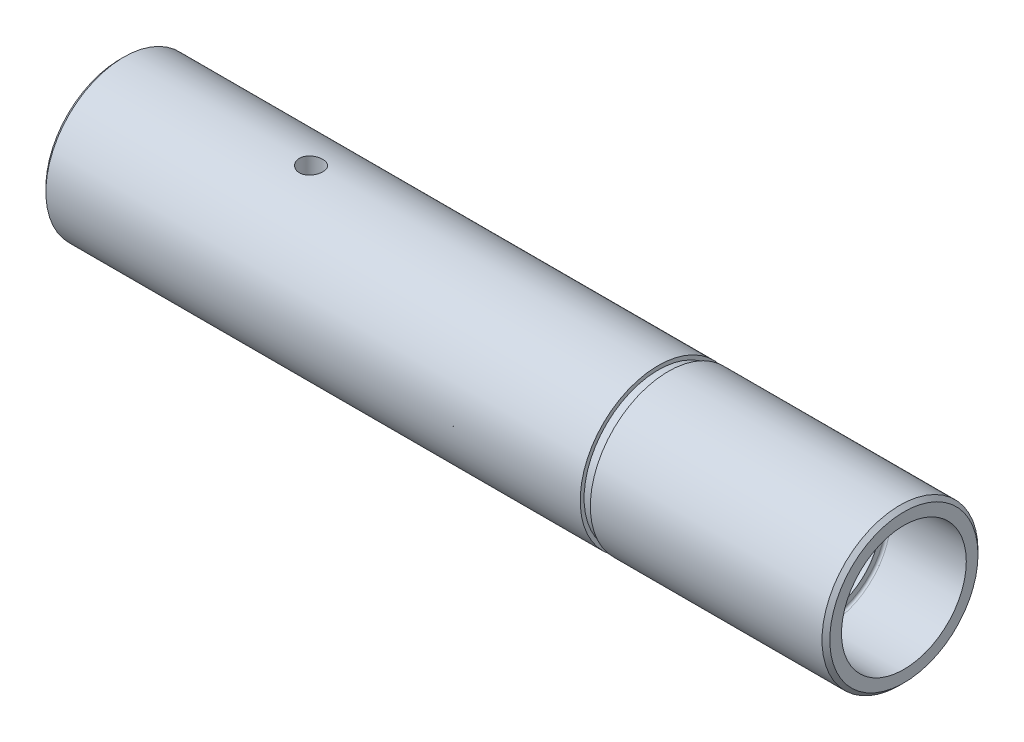
ISO-10303-21;
HEADER;
FILE_DESCRIPTION(('STEP AP214'),'2;1');
FILE_NAME('part.step','',(''),(''),'','','');
FILE_SCHEMA(('AUTOMOTIVE_DESIGN { 1 0 10303 214 1 1 1 1 }'));
ENDSEC;
DATA;
#1=APPLICATION_CONTEXT('core data for automotive mechanical design processes');
#2=APPLICATION_PROTOCOL_DEFINITION('international standard','automotive_design',2000,#1);
#3=PRODUCT_CONTEXT('',#1,'mechanical');
#4=PRODUCT('Part','Part','',(#3));
#5=PRODUCT_RELATED_PRODUCT_CATEGORY('part','',(#4));
#6=PRODUCT_DEFINITION_FORMATION('','',#4);
#7=PRODUCT_DEFINITION_CONTEXT('part definition',#1,'design');
#8=PRODUCT_DEFINITION('design','',#6,#7);
#9=PRODUCT_DEFINITION_SHAPE('','',#8);
#10=(LENGTH_UNIT() NAMED_UNIT(*) SI_UNIT(.MILLI.,.METRE.));
#11=(NAMED_UNIT(*) PLANE_ANGLE_UNIT() SI_UNIT($,.RADIAN.));
#12=(NAMED_UNIT(*) SI_UNIT($,.STERADIAN.) SOLID_ANGLE_UNIT());
#13=UNCERTAINTY_MEASURE_WITH_UNIT(LENGTH_MEASURE(1.E-05),#10,'distance_accuracy_value','');
#14=(GEOMETRIC_REPRESENTATION_CONTEXT(3) GLOBAL_UNCERTAINTY_ASSIGNED_CONTEXT((#13)) GLOBAL_UNIT_ASSIGNED_CONTEXT((#10,
#11,#12)) REPRESENTATION_CONTEXT('',''));
#15=CARTESIAN_POINT('',(0.,0.,0.));
#16=DIRECTION('',(0.,0.,1.));
#17=DIRECTION('',(1.,0.,0.));
#18=AXIS2_PLACEMENT_3D('',#15,#16,#17);
#19=CARTESIAN_POINT('',(100.5,0.,0.));
#20=DIRECTION('',(-1.,0.,0.));
#21=DIRECTION('',(0.,0.,1.));
#22=AXIS2_PLACEMENT_3D('',#19,#20,#21);
#23=CYLINDRICAL_SURFACE('',#22,10.);
#24=CARTESIAN_POINT('',(0.499999999999987,0.,0.));
#25=DIRECTION('',(1.,0.,0.));
#26=DIRECTION('',(0.,0.,-1.));
#27=AXIS2_PLACEMENT_3D('',#24,#25,#26);
#28=CIRCLE('',#27,10.);
#29=CARTESIAN_POINT('',(0.499999999999987,0.,-10.));
#30=VERTEX_POINT('',#29);
#31=EDGE_CURVE('E59',#30,#30,#28,.T.);
#32=ORIENTED_EDGE('',*,*,#31,.T.);
#33=EDGE_LOOP('',(#32));
#34=FACE_BOUND('',#33,.T.);
#35=CARTESIAN_POINT('',(23.,-10.,0.));
#36=CARTESIAN_POINT('',(23.0000034538152,-9.99999865771297,0.0837515444816421));
#37=CARTESIAN_POINT('',(23.0070380008406,-9.9989368253704,0.167551685082132));
#38=CARTESIAN_POINT('',(23.0349831999828,-9.99480315973187,0.332809627994913));
#39=CARTESIAN_POINT('',(23.0559073629449,-9.99172936938473,0.414265068974229));
#40=CARTESIAN_POINT('',(23.1109925049676,-9.98391721219526,0.57241808622186));
#41=CARTESIAN_POINT('',(23.145143479506,-9.97918010370919,0.649119207826799));
#42=CARTESIAN_POINT('',(23.2256883794169,-9.96856475911724,0.795690428635255));
#43=CARTESIAN_POINT('',(23.2720806044174,-9.96268668152773,0.865561474725189));
#44=CARTESIAN_POINT('',(23.3761772649399,-9.95039170991452,0.997046719562126));
#45=CARTESIAN_POINT('',(23.4339584562082,-9.94397133890331,1.0585998322255));
#46=CARTESIAN_POINT('',(23.5590276888939,-9.93134261133238,1.17117490668949));
#47=CARTESIAN_POINT('',(23.6263162767785,-9.92513426698505,1.22219626272936));
#48=CARTESIAN_POINT('',(23.7689006435225,-9.91359877458726,1.31249729499943));
#49=CARTESIAN_POINT('',(23.8442342469813,-9.90827611975031,1.35171787037205));
#50=CARTESIAN_POINT('',(24.0005128206454,-9.89916211306268,1.41692632171056));
#51=CARTESIAN_POINT('',(24.0814574847439,-9.89537067775449,1.44291491889163));
#52=CARTESIAN_POINT('',(24.2460180418717,-9.88978256218673,1.48073198798911));
#53=CARTESIAN_POINT('',(24.329609393408,-9.8879711574125,1.49266503640518));
#54=CARTESIAN_POINT('',(24.4976261659873,-9.88650348970582,1.50235624033932));
#55=CARTESIAN_POINT('',(24.5820515388625,-9.88684710303147,1.50011520973796));
#56=CARTESIAN_POINT('',(24.7486010801941,-9.88963718352409,1.48160733250788));
#57=CARTESIAN_POINT('',(24.8307385264848,-9.89206618761549,1.4654569592775));
#58=CARTESIAN_POINT('',(24.9911243688715,-9.89872608126367,1.41977117403734));
#59=CARTESIAN_POINT('',(25.0693726548807,-9.90295702179379,1.39023538337812));
#60=CARTESIAN_POINT('',(25.2201133712829,-9.91276335545481,1.31849603529737));
#61=CARTESIAN_POINT('',(25.2925819690924,-9.91834396766526,1.27624314283198));
#62=CARTESIAN_POINT('',(25.4294445957819,-9.93021707574548,1.18030413128955));
#63=CARTESIAN_POINT('',(25.4938380942694,-9.93650961832501,1.12661726182478));
#64=CARTESIAN_POINT('',(25.6133976607397,-9.94917473056209,1.00869493078248));
#65=CARTESIAN_POINT('',(25.6684649902863,-9.95554747112815,0.944359329642003));
#66=CARTESIAN_POINT('',(25.7670359345073,-9.96759647648462,0.807307089894187));
#67=CARTESIAN_POINT('',(25.8105394985439,-9.9732727382251,0.734590414588171));
#68=CARTESIAN_POINT('',(25.8847530864995,-9.98329515585393,0.582754598213686));
#69=CARTESIAN_POINT('',(25.9154554918403,-9.98764051925428,0.50363167783678));
#70=CARTESIAN_POINT('',(25.9631093896854,-9.99450490557069,0.34127318248706));
#71=CARTESIAN_POINT('',(25.9800618118156,-9.99702405195467,0.2580378859526));
#72=CARTESIAN_POINT('',(25.9996032298167,-9.99993581133871,0.0906695676436462));
#73=CARTESIAN_POINT('',(26.0023279713793,-10.0003485209039,0.00655273187047008));
#74=CARTESIAN_POINT('',(25.993696994689,-9.99905561015226,-0.160936677662283));
#75=CARTESIAN_POINT('',(25.9823417123319,-9.99735005541369,-0.244309274381877));
#76=CARTESIAN_POINT('',(25.9459858998225,-9.99202468615333,-0.407532387431408));
#77=CARTESIAN_POINT('',(25.9210515039692,-9.98841415207984,-0.487397963079839));
#78=CARTESIAN_POINT('',(25.8583150025382,-9.97968235658369,-0.641814958643));
#79=CARTESIAN_POINT('',(25.8205122926664,-9.97456102421565,-0.716366128795099));
#80=CARTESIAN_POINT('',(25.7327937754361,-9.96332682468686,-0.85863497929192));
#81=CARTESIAN_POINT('',(25.6827918599872,-9.95720701626745,-0.926299009891565));
#82=CARTESIAN_POINT('',(25.5722141883713,-9.94467863012165,-1.05232367317771));
#83=CARTESIAN_POINT('',(25.5116378176754,-9.93827003562867,-1.1106837647934));
#84=CARTESIAN_POINT('',(25.3810264668235,-9.92582264304494,-1.21693784957195));
#85=CARTESIAN_POINT('',(25.3109170748052,-9.91978736017588,-1.26474084747421));
#86=CARTESIAN_POINT('',(25.1635839594882,-9.90883219104903,-1.34789129270584));
#87=CARTESIAN_POINT('',(25.0863604284785,-9.90391227465628,-1.38323907656436));
#88=CARTESIAN_POINT('',(24.9272624663769,-9.89577033008645,-1.44033467323943));
#89=CARTESIAN_POINT('',(24.8454055390288,-9.89254233006438,-1.46213037141635));
#90=CARTESIAN_POINT('',(24.6791409845649,-9.88813382297802,-1.49165549501586));
#91=CARTESIAN_POINT('',(24.5947335340053,-9.88695317451771,-1.49938589183067));
#92=CARTESIAN_POINT('',(24.4266709366842,-9.88677832610841,-1.5005378666944));
#93=CARTESIAN_POINT('',(24.3430167582431,-9.88776226333502,-1.49410252167313));
#94=CARTESIAN_POINT('',(24.1779947366765,-9.89175820611174,-1.46741229544379));
#95=CARTESIAN_POINT('',(24.0966268898866,-9.89477020841117,-1.44715743638627));
#96=CARTESIAN_POINT('',(23.9385269177657,-9.90247526112297,-1.39345373518665));
#97=CARTESIAN_POINT('',(23.8617913295666,-9.90716703716075,-1.36001489324314));
#98=CARTESIAN_POINT('',(23.7149963661976,-9.91770454557702,-1.28090667642309));
#99=CARTESIAN_POINT('',(23.6449372171964,-9.92355031702724,-1.23523688741502));
#100=CARTESIAN_POINT('',(23.5127569420248,-9.93580743364938,-1.13244337659164));
#101=CARTESIAN_POINT('',(23.4507186667529,-9.94222367881967,-1.07521369039806));
#102=CARTESIAN_POINT('',(23.3370754452122,-9.95485788826636,-0.951148841082835));
#103=CARTESIAN_POINT('',(23.2854729274238,-9.96107580610759,-0.884311448350941));
#104=CARTESIAN_POINT('',(23.1939123233926,-9.9726518579052,-0.742495707543721));
#105=CARTESIAN_POINT('',(23.1540198907853,-9.9780050712882,-0.667474576764759));
#106=CARTESIAN_POINT('',(23.087461483242,-9.98720028802959,-0.511751870248718));
#107=CARTESIAN_POINT('',(23.0607818099463,-9.99104385565757,-0.431056277096704));
#108=CARTESIAN_POINT('',(23.0274586572899,-9.99590939261505,-0.291665727889329));
#109=CARTESIAN_POINT('',(23.0171773984612,-9.99743549179557,-0.233831133495278));
#110=CARTESIAN_POINT('',(23.0034469022874,-9.99948125947896,-0.117338971600125));
#111=CARTESIAN_POINT('',(22.9999975800475,-10.0000009404877,-0.0586814143344171));
#112=CARTESIAN_POINT('',(23.,-10.,0.));
#113=B_SPLINE_CURVE_WITH_KNOTS('',3,(#35,#36,#37,#38,#39,#40,#41,#42,#43,#44,#45,#46,#47,#48,
#49,#50,#51,#52,#53,#54,#55,#56,#57,#58,#59,#60,#61,#62,#63,#64,#65,#66,#67,#68,#69,#70,#71,#72,
#73,#74,#75,#76,#77,#78,#79,#80,#81,#82,#83,#84,#85,#86,#87,#88,#89,#90,#91,#92,#93,#94,#95,#96,
#97,#98,#99,#100,#101,#102,#103,#104,#105,#106,#107,#108,#109,#110,#111,#112),.UNSPECIFIED.,.T.,
.F.,(4,2,2,2,2,2,2,2,2,2,2,2,2,2,2,2,2,2,2,2,2,2,2,2,2,2,2,2,2,2,2,2,2,2,2,2,2,2,4),(0.,
0.251040205031663,0.50232496292915,0.753420023583237,1.0044802241976,1.25729416136843,
1.5101226357258,1.76419702395375,2.01825756225506,2.27041564605924,2.52255925098982,
2.77261177195746,3.02267136690361,3.27371383476159,3.52477278308534,3.77834291255409,
4.03191415238668,4.28563608984875,4.53934087193401,4.79062058544255,5.04189251991155,
5.29195148965948,5.54202220376274,5.79391188036907,6.0458162002863,6.29981366584672,
6.55380426808832,6.80689223457168,7.05996272137177,7.31048888261064,7.56101464229564,
7.81135073984147,8.0616953146688,8.31444829965721,8.56726003468734,8.82146323384734,
9.07540233261442,9.25129851978809,9.42719252123291),.UNSPECIFIED.);
#114=CARTESIAN_POINT('',(23.,-10.,0.));
#115=VERTEX_POINT('',#114);
#116=EDGE_CURVE('E100',#115,#115,#113,.T.);
#117=ORIENTED_EDGE('',*,*,#116,.T.);
#118=EDGE_LOOP('',(#117));
#119=FACE_BOUND('',#118,.T.);
#120=CARTESIAN_POINT('',(24.5,9.88685996664259,1.5));
#121=CARTESIAN_POINT('',(24.41625443071,9.88686136668593,1.49999654107284));
#122=CARTESIAN_POINT('',(24.3324602492493,9.88793551739101,1.49296296388491));
#123=CARTESIAN_POINT('',(24.1672146851169,9.8921131480324,1.46502196657001));
#124=CARTESIAN_POINT('',(24.08576566852,9.8952186073143,1.44410101402628));
#125=CARTESIAN_POINT('',(23.9276262445531,9.90309938986228,1.38902526098084));
#126=CARTESIAN_POINT('',(23.8509322374578,9.90787343131536,1.35488061681397));
#127=CARTESIAN_POINT('',(23.7043729692279,9.91855194113145,1.27435063087791));
#128=CARTESIAN_POINT('',(23.6345067697857,9.92445625383668,1.22796697429872));
#129=CARTESIAN_POINT('',(23.5030161832457,9.9367828924804,1.12387902418559));
#130=CARTESIAN_POINT('',(23.4414543865933,9.94320862458057,1.0660960558482));
#131=CARTESIAN_POINT('',(23.3288625143445,9.95582368169047,0.941019605444376));
#132=CARTESIAN_POINT('',(23.277833017833,9.96201299368615,0.873725600786532));
#133=CARTESIAN_POINT('',(23.1875233683086,9.97349347428185,0.731136358052747));
#134=CARTESIAN_POINT('',(23.1483008496775,9.97878018435569,0.655804227365769));
#135=CARTESIAN_POINT('',(23.0830884011918,9.98782206746405,0.499528850106976));
#136=CARTESIAN_POINT('',(23.0570977721571,9.99157732141945,0.418585900270678));
#137=CARTESIAN_POINT('',(23.0192766114692,9.99710914797782,0.254031123090569));
#138=CARTESIAN_POINT('',(23.0073412736128,9.99890035887344,0.170443884389866));
#139=CARTESIAN_POINT('',(22.9976440651751,10.0003524476958,0.00243520401947946));
#140=CARTESIAN_POINT('',(22.9998814066803,10.0000134440494,-0.0819861910157454));
#141=CARTESIAN_POINT('',(23.0183833377624,9.99725499660796,-0.248551718200518));
#142=CARTESIAN_POINT('',(23.0345351717915,9.99485227652479,-0.330708691400006));
#143=CARTESIAN_POINT('',(23.0802306063226,9.98825500227851,-0.491132829143136));
#144=CARTESIAN_POINT('',(23.1097745515014,9.98406040199739,-0.56939989351348));
#145=CARTESIAN_POINT('',(23.1815309969171,9.97432193873206,-0.720163780770315));
#146=CARTESIAN_POINT('',(23.2237909651087,9.96877303515638,-0.792637672323595));
#147=CARTESIAN_POINT('',(23.31974519367,9.95694438245421,-0.929507907150176));
#148=CARTESIAN_POINT('',(23.3734402067069,9.95066458523184,-0.993903718271734));
#149=CARTESIAN_POINT('',(23.4913684488266,9.93800158192627,-1.11345448272264));
#150=CARTESIAN_POINT('',(23.5557001219701,9.93161796623256,-1.16851232950947));
#151=CARTESIAN_POINT('',(23.6927410771237,9.91952704453523,-1.26706599338813));
#152=CARTESIAN_POINT('',(23.7654504107199,9.91381974269649,-1.31056173927999));
#153=CARTESIAN_POINT('',(23.9172839629406,9.90372775286855,-1.38476964534605));
#154=CARTESIAN_POINT('',(23.9964131336624,9.89934409845291,-1.41547182270082));
#155=CARTESIAN_POINT('',(24.1587852551474,9.89241402899059,-1.46312336208879));
#156=CARTESIAN_POINT('',(24.2420279155468,9.88986748446299,-1.48007369337326));
#157=CARTESIAN_POINT('',(24.4094000895775,9.88692451395027,-1.49960720086655));
#158=CARTESIAN_POINT('',(24.4935131882015,9.88650748802574,-1.50232803265052));
#159=CARTESIAN_POINT('',(24.6609941948173,9.88781607937153,-1.49369057019819));
#160=CARTESIAN_POINT('',(24.7443621258508,9.88954163015778,-1.48233271282302));
#161=CARTESIAN_POINT('',(24.9075598179656,9.89492202461453,-1.44597702952766));
#162=CARTESIAN_POINT('',(24.9874052049416,9.89856716482858,-1.42104778527821));
#163=CARTESIAN_POINT('',(25.1417840920486,9.90736801825768,-1.35832831947087));
#164=CARTESIAN_POINT('',(25.2163173296282,9.91252380607176,-1.32053746276389));
#165=CARTESIAN_POINT('',(25.358573260335,9.92381355687063,-1.23283677995324));
#166=CARTESIAN_POINT('',(25.4262404472798,9.92995459279988,-1.18283784561767));
#167=CARTESIAN_POINT('',(25.5522728598738,9.94250159433355,-1.07226416837202));
#168=CARTESIAN_POINT('',(25.6106375591811,9.94890757490292,-1.0116888274468));
#169=CARTESIAN_POINT('',(25.7169026066336,9.96132705217386,-0.881075619628186));
#170=CARTESIAN_POINT('',(25.7647117282425,9.96733683460423,-0.81096312677196));
#171=CARTESIAN_POINT('',(25.8478729052626,9.97822905032015,-0.663622080263684));
#172=CARTESIAN_POINT('',(25.883225301465,9.98311151444563,-0.586393721360441));
#173=CARTESIAN_POINT('',(25.940323742488,9.99118269660795,-0.427297995861148));
#174=CARTESIAN_POINT('',(25.9621196670784,9.99437761717899,-0.345448858754304));
#175=CARTESIAN_POINT('',(25.9916478795375,9.99873976656896,-0.179200815501195));
#176=CARTESIAN_POINT('',(25.9993810962491,9.99990712930801,-0.0948020781305827));
#177=CARTESIAN_POINT('',(26.0005417045494,10.0000812905914,0.0732645908608167));
#178=CARTESIAN_POINT('',(25.994108680877,9.99910917023796,0.15693157021205));
#179=CARTESIAN_POINT('',(25.9674186115792,9.99515610519141,0.321979795323105));
#180=CARTESIAN_POINT('',(25.9471616101914,9.99217516692666,0.403361048396511));
#181=CARTESIAN_POINT('',(25.8934481244298,9.98453786742463,0.561489374379659));
#182=CARTESIAN_POINT('',(25.8600013048611,9.97988273316947,0.638239793148781));
#183=CARTESIAN_POINT('',(25.7808725120169,9.96940834495499,0.785061117896601));
#184=CARTESIAN_POINT('',(25.7351901415197,9.96358905320338,0.855131806920708));
#185=CARTESIAN_POINT('',(25.6323823011708,9.95136510636178,0.987312585191959));
#186=CARTESIAN_POINT('',(25.5751537741837,9.94495548425942,1.04934206644638));
#187=CARTESIAN_POINT('',(25.4510949269195,9.93231001689001,1.16296808390268));
#188=CARTESIAN_POINT('',(25.3842623561757,9.92607421276291,1.21456216798984));
#189=CARTESIAN_POINT('',(25.2424510167675,9.91444484029116,1.30611310822974));
#190=CARTESIAN_POINT('',(25.1674285829782,9.90905620156985,1.34600294291209));
#191=CARTESIAN_POINT('',(25.0117032232367,9.89978909110724,1.41255613872045));
#192=CARTESIAN_POINT('',(24.9310062921422,9.89590905307931,1.43923322574898));
#193=CARTESIAN_POINT('',(24.7916225637435,9.89099485524825,1.47254951890026));
#194=CARTESIAN_POINT('',(24.7337966030757,9.88945249382379,1.4828276978042));
#195=CARTESIAN_POINT('',(24.6173217082656,9.88738456567011,1.49655410576574));
#196=CARTESIAN_POINT('',(24.5586727848004,9.88685898576155,1.50000242335076));
#197=CARTESIAN_POINT('',(24.5,9.88685996664259,1.5));
#198=B_SPLINE_CURVE_WITH_KNOTS('',3,(#120,#121,#122,#123,#124,#125,#126,#127,#128,#129,#130,
#131,#132,#133,#134,#135,#136,#137,#138,#139,#140,#141,#142,#143,#144,#145,#146,#147,#148,#149,
#150,#151,#152,#153,#154,#155,#156,#157,#158,#159,#160,#161,#162,#163,#164,#165,#166,#167,#168,
#169,#170,#171,#172,#173,#174,#175,#176,#177,#178,#179,#180,#181,#182,#183,#184,#185,#186,#187,
#188,#189,#190,#191,#192,#193,#194,#195,#196,#197),.UNSPECIFIED.,.T.,.F.,(4,2,2,2,2,2,2,2,2,2,2,
2,2,2,2,2,2,2,2,2,2,2,2,2,2,2,2,2,2,2,2,2,2,2,2,2,2,2,4),(0.,0.251022251804865,0.5022894695618,
0.753364085335672,1.00440414866132,1.25724158649107,1.51009292207817,1.76415922105782,
2.01821209364501,2.27035832534397,2.52249053939374,2.77259862515728,3.02271314839401,
3.27377316386454,3.52484970949272,3.77839544666269,4.0319427451435,4.28568751773139,
4.53941440444341,4.79068214603744,5.04194209099918,5.29194394807374,5.54195815286117,
5.79385486001302,6.04576581461802,6.29977537753516,6.55377799071854,6.8068404089109,
7.05988611170473,7.31044963622327,7.56101235892823,7.81139182257833,8.06177941567107,
8.3145095001097,8.56729890236863,8.82150878824932,9.07545403445564,9.25132441891614,
9.42719252376193),.UNSPECIFIED.);
#199=CARTESIAN_POINT('',(24.5,9.88685996664259,1.5));
#200=VERTEX_POINT('',#199);
#201=EDGE_CURVE('E71',#200,#200,#198,.T.);
#202=ORIENTED_EDGE('',*,*,#201,.T.);
#203=EDGE_LOOP('',(#202));
#204=FACE_BOUND('',#203,.T.);
#205=CARTESIAN_POINT('',(69.,0.,0.));
#206=DIRECTION('',(1.,0.,0.));
#207=DIRECTION('',(0.,0.,-1.));
#208=AXIS2_PLACEMENT_3D('',#205,#206,#207);
#209=CIRCLE('',#208,10.);
#210=CARTESIAN_POINT('',(69.,0.,-10.));
#211=VERTEX_POINT('',#210);
#212=EDGE_CURVE('E145',#211,#211,#209,.T.);
#213=ORIENTED_EDGE('',*,*,#212,.F.);
#214=EDGE_LOOP('',(#213));
#215=FACE_BOUND('',#214,.T.);
#216=ADVANCED_FACE('F30',(#34,#119,#204,#215),#23,.T.);
#217=CARTESIAN_POINT('',(100.5,0.,0.));
#218=DIRECTION('',(-1.,0.,0.));
#219=DIRECTION('',(0.,0.,1.));
#220=AXIS2_PLACEMENT_3D('',#217,#218,#219);
#221=CYLINDRICAL_SURFACE('',#220,7.);
#222=CARTESIAN_POINT('',(24.5,-6.83739716558867,1.5));
#223=CARTESIAN_POINT('',(24.583211152482,-6.83739884558951,1.49999708238613));
#224=CARTESIAN_POINT('',(24.6664577739421,-6.83893272341929,1.49305236244768));
#225=CARTESIAN_POINT('',(24.830586672242,-6.84489178429867,1.46548559252999));
#226=CARTESIAN_POINT('',(24.9114671486762,-6.84931911211841,1.44485339653622));
#227=CARTESIAN_POINT('',(25.0684657495742,-6.86054115293409,1.39058863684599));
#228=CARTESIAN_POINT('',(25.1445888781215,-6.86733332725825,1.35697000991314));
#229=CARTESIAN_POINT('',(25.2901152739446,-6.88251670848644,1.27772617673341));
#230=CARTESIAN_POINT('',(25.3595187370291,-6.89090786877545,1.23210132048776));
#231=CARTESIAN_POINT('',(25.4907629614821,-6.90849578796654,1.12935142570221));
#232=CARTESIAN_POINT('',(25.55247887624,-6.91770249871753,1.07206859483983));
#233=CARTESIAN_POINT('',(25.6655035544058,-6.93579691710397,0.947969508129577));
#234=CARTESIAN_POINT('',(25.7168115288601,-6.94468460051416,0.881152530217677));
#235=CARTESIAN_POINT('',(25.8080554444914,-6.96124769109432,0.739047288464582));
#236=CARTESIAN_POINT('',(25.8478716557706,-6.96890998819429,0.663680488229953));
#237=CARTESIAN_POINT('',(25.9142276914463,-6.98204671042934,0.507134269342594));
#238=CARTESIAN_POINT('',(25.9407689447863,-6.98752137103329,0.425955477380311));
#239=CARTESIAN_POINT('',(25.9794299709313,-6.9955956528118,0.261387187671511));
#240=CARTESIAN_POINT('',(25.9917609285524,-6.99823733378385,0.178049400596922));
#241=CARTESIAN_POINT('',(26.0023112773133,-7.00049362207002,0.010448945306644));
#242=CARTESIAN_POINT('',(26.0005322205608,-7.00010856232698,-0.0738136201647595));
#243=CARTESIAN_POINT('',(25.9830710353364,-6.99638700862558,-0.239417029250512));
#244=CARTESIAN_POINT('',(25.9676164997101,-6.99309883152432,-0.320783115362112));
#245=CARTESIAN_POINT('',(25.9236053181481,-6.98399541589104,-0.479739463978388));
#246=CARTESIAN_POINT('',(25.8950480957003,-6.97818006616518,-0.557329560175053));
#247=CARTESIAN_POINT('',(25.8254385411115,-6.96459754646858,-0.707167497556553));
#248=CARTESIAN_POINT('',(25.7842992327957,-6.95681685803946,-0.77937365701579));
#249=CARTESIAN_POINT('',(25.6907580318364,-6.94015793743865,-0.915940926562848));
#250=CARTESIAN_POINT('',(25.6383546626997,-6.93127956144693,-0.98030100645153));
#251=CARTESIAN_POINT('',(25.5225314554721,-6.91319326460925,-1.10070208800198));
#252=CARTESIAN_POINT('',(25.458912420643,-6.90398230372853,-1.15655117320251));
#253=CARTESIAN_POINT('',(25.3231167149315,-6.88643566831974,-1.25682243234728));
#254=CARTESIAN_POINT('',(25.2509398305948,-6.87810001563386,-1.30124432118068));
#255=CARTESIAN_POINT('',(25.0997754989362,-6.86324023586723,-1.37748077573296));
#256=CARTESIAN_POINT('',(25.0207698761476,-6.85672115127775,-1.40926035088923));
#257=CARTESIAN_POINT('',(24.8583672340536,-6.84630340806617,-1.45903495159115));
#258=CARTESIAN_POINT('',(24.7749708825568,-6.84240435218483,-1.47703206694628));
#259=CARTESIAN_POINT('',(24.6079042473503,-6.83774881255446,-1.49843586024652));
#260=CARTESIAN_POINT('',(24.5242713249227,-6.83693227051701,-1.5021214192864));
#261=CARTESIAN_POINT('',(24.3575860068183,-6.83837239573994,-1.49555139642373));
#262=CARTESIAN_POINT('',(24.2745335733464,-6.84062886101063,-1.48529673081635));
#263=CARTESIAN_POINT('',(24.1123295650192,-6.84790415484206,-1.45137894635584));
#264=CARTESIAN_POINT('',(24.033144567403,-6.85289155274364,-1.42786830251554));
#265=CARTESIAN_POINT('',(23.8798376624671,-6.86503859869777,-1.3682705294675));
#266=CARTESIAN_POINT('',(23.8057162243658,-6.87219844772849,-1.33218223662818));
#267=CARTESIAN_POINT('',(23.6634303152411,-6.88801634080345,-1.24783504416705));
#268=CARTESIAN_POINT('',(23.5953704179878,-6.89669501746317,-1.19940368590792));
#269=CARTESIAN_POINT('',(23.4682416541262,-6.91451775360139,-1.091971838336));
#270=CARTESIAN_POINT('',(23.4091738585515,-6.92366186834461,-1.03297009182161));
#271=CARTESIAN_POINT('',(23.3006296970552,-6.94158239990173,-0.904812764420814));
#272=CARTESIAN_POINT('',(23.251343083843,-6.95034935607746,-0.83549492582877));
#273=CARTESIAN_POINT('',(23.165114590649,-6.96635610714901,-0.689401481282275));
#274=CARTESIAN_POINT('',(23.1281721470272,-6.97359597176692,-0.612626216043738));
#275=CARTESIAN_POINT('',(23.0679479453615,-6.98569278381574,-0.45426541898204));
#276=CARTESIAN_POINT('',(23.0445816962537,-6.99056443803698,-0.372713193075172));
#277=CARTESIAN_POINT('',(23.0119082942677,-6.9974393930198,-0.206725177003289));
#278=CARTESIAN_POINT('',(23.0025991840261,-6.99944309312296,-0.122289789973993));
#279=CARTESIAN_POINT('',(22.9983893475881,-7.00034511009057,0.0452637170528302));
#280=CARTESIAN_POINT('',(23.0032048413954,-6.99930459001667,0.12837450550923));
#281=CARTESIAN_POINT('',(23.026474763519,-6.99436552363383,0.292572938415962));
#282=CARTESIAN_POINT('',(23.0449289655783,-6.99046702473686,0.373660616405286));
#283=CARTESIAN_POINT('',(23.0948188062495,-6.98025388638537,0.53130194848727));
#284=CARTESIAN_POINT('',(23.1262156893856,-6.97394646430493,0.607868365073177));
#285=CARTESIAN_POINT('',(23.2010612711691,-6.95959036050661,0.75468495672322));
#286=CARTESIAN_POINT('',(23.244511088306,-6.9515415172034,0.824934544796141));
#287=CARTESIAN_POINT('',(23.3431623187427,-6.93439809934493,0.958512306895244));
#288=CARTESIAN_POINT('',(23.3985641583213,-6.92528708907874,1.02169036510578));
#289=CARTESIAN_POINT('',(23.5191406102503,-6.90713690075836,1.13795001457643));
#290=CARTESIAN_POINT('',(23.5843175633556,-6.89809774045682,1.19102918062422));
#291=CARTESIAN_POINT('',(23.7235904931857,-6.88098693651916,1.28623261596675));
#292=CARTESIAN_POINT('',(23.797789358287,-6.87292905956533,1.32820897809616));
#293=CARTESIAN_POINT('',(23.9523437209233,-6.85886497228049,1.39903004659825));
#294=CARTESIAN_POINT('',(24.0326938452531,-6.85285699581573,1.42788606423931));
#295=CARTESIAN_POINT('',(24.1776261311859,-6.84470560641996,1.46638607121558));
#296=CARTESIAN_POINT('',(24.2414116757078,-6.84198283087953,1.47896752507743));
#297=CARTESIAN_POINT('',(24.3701243115773,-6.83832799504406,1.49577544043437));
#298=CARTESIAN_POINT('',(24.4350513515083,-6.83739585430069,1.50000227727981));
#299=CARTESIAN_POINT('',(24.5,-6.83739716558867,1.5));
#300=B_SPLINE_CURVE_WITH_KNOTS('',3,(#222,#223,#224,#225,#226,#227,#228,#229,#230,#231,#232,
#233,#234,#235,#236,#237,#238,#239,#240,#241,#242,#243,#244,#245,#246,#247,#248,#249,#250,#251,
#252,#253,#254,#255,#256,#257,#258,#259,#260,#261,#262,#263,#264,#265,#266,#267,#268,#269,#270,
#271,#272,#273,#274,#275,#276,#277,#278,#279,#280,#281,#282,#283,#284,#285,#286,#287,#288,#289,
#290,#291,#292,#293,#294,#295,#296,#297,#298,#299),.UNSPECIFIED.,.T.,.F.,(4,2,2,2,2,2,2,2,2,2,2,
2,2,2,2,2,2,2,2,2,2,2,2,2,2,2,2,2,2,2,2,2,2,2,2,2,2,2,4),(0.,0.249395482027527,
0.498976038479964,0.74828949115276,0.997595676735285,1.25053229582692,1.50348808112879,
1.75899134820278,2.01446710646268,2.26609508151929,2.51769537777241,2.76518557667371,
3.01268666607584,3.26193888143437,3.51122378872315,3.76548960779295,4.01976177023092,
4.27473287411781,4.52966530953839,4.77960433192523,5.02952692653917,5.27663180749375,
5.5237595556315,5.77455010216318,6.02537049659078,6.28066214683211,6.53594213875542,
6.78961589824375,7.04325433208539,7.29183199644127,7.540405537151,7.78824009619483,
8.03609766151366,8.28848914160965,8.54094115631233,8.79660380167249,9.05204561611688,
9.24671456122272,9.44137476018023),.UNSPECIFIED.);
#301=CARTESIAN_POINT('',(24.5,-6.83739716558867,1.5));
#302=VERTEX_POINT('',#301);
#303=EDGE_CURVE('E63',#302,#302,#300,.T.);
#304=ORIENTED_EDGE('',*,*,#303,.F.);
#305=EDGE_LOOP('',(#304));
#306=FACE_BOUND('',#305,.T.);
#307=CARTESIAN_POINT('',(24.5,6.83739716558867,1.5));
#308=CARTESIAN_POINT('',(24.416788847518,6.83739884558951,1.49999708238613));
#309=CARTESIAN_POINT('',(24.3335422260579,6.83893272341929,1.49305236244768));
#310=CARTESIAN_POINT('',(24.169413327758,6.84489178429867,1.46548559252999));
#311=CARTESIAN_POINT('',(24.0885328513238,6.84931911211841,1.44485339653622));
#312=CARTESIAN_POINT('',(23.9315342504258,6.86054115293409,1.39058863684599));
#313=CARTESIAN_POINT('',(23.8554111218785,6.86733332725825,1.35697000991314));
#314=CARTESIAN_POINT('',(23.7098847260554,6.88251670848644,1.27772617673341));
#315=CARTESIAN_POINT('',(23.6404812629709,6.89090786877545,1.23210132048776));
#316=CARTESIAN_POINT('',(23.5092370385179,6.90849578796654,1.12935142570221));
#317=CARTESIAN_POINT('',(23.44752112376,6.91770249871753,1.07206859483983));
#318=CARTESIAN_POINT('',(23.3344964455942,6.93579691710397,0.947969508129577));
#319=CARTESIAN_POINT('',(23.2831884711399,6.94468460051416,0.881152530217677));
#320=CARTESIAN_POINT('',(23.1919445555086,6.96124769109432,0.739047288464582));
#321=CARTESIAN_POINT('',(23.1521283442294,6.96890998819429,0.663680488229953));
#322=CARTESIAN_POINT('',(23.0857723085537,6.98204671042934,0.507134269342594));
#323=CARTESIAN_POINT('',(23.0592310552137,6.98752137103329,0.425955477380311));
#324=CARTESIAN_POINT('',(23.0205700290687,6.9955956528118,0.261387187671511));
#325=CARTESIAN_POINT('',(23.0082390714476,6.99823733378385,0.178049400596922));
#326=CARTESIAN_POINT('',(22.9976887226867,7.00049362207002,0.010448945306644));
#327=CARTESIAN_POINT('',(22.9994677794392,7.00010856232698,-0.0738136201647595));
#328=CARTESIAN_POINT('',(23.0169289646636,6.99638700862558,-0.239417029250512));
#329=CARTESIAN_POINT('',(23.0323835002899,6.99309883152432,-0.320783115362112));
#330=CARTESIAN_POINT('',(23.0763946818519,6.98399541589104,-0.479739463978388));
#331=CARTESIAN_POINT('',(23.1049519042997,6.97818006616518,-0.557329560175054));
#332=CARTESIAN_POINT('',(23.1745614588885,6.96459754646858,-0.707167497556553));
#333=CARTESIAN_POINT('',(23.2157007672043,6.95681685803946,-0.779373657015789));
#334=CARTESIAN_POINT('',(23.3092419681636,6.94015793743865,-0.915940926562847));
#335=CARTESIAN_POINT('',(23.3616453373003,6.93127956144693,-0.980301006451529));
#336=CARTESIAN_POINT('',(23.4774685445279,6.91319326460925,-1.10070208800198));
#337=CARTESIAN_POINT('',(23.541087579357,6.90398230372853,-1.15655117320251));
#338=CARTESIAN_POINT('',(23.6768832850685,6.88643566831974,-1.25682243234728));
#339=CARTESIAN_POINT('',(23.7490601694053,6.87810001563386,-1.30124432118068));
#340=CARTESIAN_POINT('',(23.9002245010638,6.86324023586723,-1.37748077573296));
#341=CARTESIAN_POINT('',(23.9792301238524,6.85672115127775,-1.40926035088923));
#342=CARTESIAN_POINT('',(24.1416327659464,6.84630340806617,-1.45903495159115));
#343=CARTESIAN_POINT('',(24.2250291174432,6.84240435218483,-1.47703206694628));
#344=CARTESIAN_POINT('',(24.3920957526497,6.83774881255446,-1.49843586024652));
#345=CARTESIAN_POINT('',(24.4757286750773,6.83693227051701,-1.5021214192864));
#346=CARTESIAN_POINT('',(24.6424139931817,6.83837239573994,-1.49555139642373));
#347=CARTESIAN_POINT('',(24.7254664266536,6.84062886101063,-1.48529673081635));
#348=CARTESIAN_POINT('',(24.8876704349808,6.84790415484206,-1.45137894635584));
#349=CARTESIAN_POINT('',(24.966855432597,6.85289155274364,-1.42786830251554));
#350=CARTESIAN_POINT('',(25.1201623375329,6.86503859869777,-1.3682705294675));
#351=CARTESIAN_POINT('',(25.1942837756342,6.87219844772849,-1.33218223662818));
#352=CARTESIAN_POINT('',(25.3365696847589,6.88801634080345,-1.24783504416705));
#353=CARTESIAN_POINT('',(25.4046295820122,6.89669501746317,-1.19940368590792));
#354=CARTESIAN_POINT('',(25.5317583458738,6.91451775360139,-1.091971838336));
#355=CARTESIAN_POINT('',(25.5908261414485,6.92366186834461,-1.03297009182161));
#356=CARTESIAN_POINT('',(25.6993703029448,6.94158239990173,-0.904812764420814));
#357=CARTESIAN_POINT('',(25.748656916157,6.95034935607746,-0.83549492582877));
#358=CARTESIAN_POINT('',(25.8348854093511,6.96635610714901,-0.689401481282275));
#359=CARTESIAN_POINT('',(25.8718278529728,6.97359597176692,-0.612626216043738));
#360=CARTESIAN_POINT('',(25.9320520546385,6.98569278381574,-0.454265418982039));
#361=CARTESIAN_POINT('',(25.9554183037463,6.99056443803698,-0.372713193075171));
#362=CARTESIAN_POINT('',(25.9880917057323,6.9974393930198,-0.206725177003288));
#363=CARTESIAN_POINT('',(25.9974008159739,6.99944309312296,-0.122289789973992));
#364=CARTESIAN_POINT('',(26.0016106524119,7.00034511009057,0.0452637170528302));
#365=CARTESIAN_POINT('',(25.9967951586046,6.99930459001667,0.12837450550923));
#366=CARTESIAN_POINT('',(25.973525236481,6.99436552363383,0.292572938415962));
#367=CARTESIAN_POINT('',(25.9550710344217,6.99046702473686,0.373660616405286));
#368=CARTESIAN_POINT('',(25.9051811937505,6.98025388638537,0.53130194848727));
#369=CARTESIAN_POINT('',(25.8737843106144,6.97394646430493,0.607868365073177));
#370=CARTESIAN_POINT('',(25.7989387288309,6.95959036050661,0.75468495672322));
#371=CARTESIAN_POINT('',(25.755488911694,6.9515415172034,0.824934544796141));
#372=CARTESIAN_POINT('',(25.6568376812573,6.93439809934493,0.958512306895244));
#373=CARTESIAN_POINT('',(25.6014358416787,6.92528708907874,1.02169036510578));
#374=CARTESIAN_POINT('',(25.4808593897497,6.90713690075836,1.13795001457643));
#375=CARTESIAN_POINT('',(25.4156824366444,6.89809774045682,1.19102918062422));
#376=CARTESIAN_POINT('',(25.2764095068143,6.88098693651916,1.28623261596675));
#377=CARTESIAN_POINT('',(25.202210641713,6.87292905956533,1.32820897809616));
#378=CARTESIAN_POINT('',(25.0476562790768,6.85886497228049,1.39903004659825));
#379=CARTESIAN_POINT('',(24.9673061547469,6.85285699581573,1.42788606423931));
#380=CARTESIAN_POINT('',(24.8223738688141,6.84470560641996,1.46638607121558));
#381=CARTESIAN_POINT('',(24.7585883242922,6.84198283087953,1.47896752507743));
#382=CARTESIAN_POINT('',(24.6298756884227,6.83832799504406,1.49577544043437));
#383=CARTESIAN_POINT('',(24.5649486484917,6.83739585430069,1.50000227727981));
#384=CARTESIAN_POINT('',(24.5,6.83739716558867,1.5));
#385=B_SPLINE_CURVE_WITH_KNOTS('',3,(#307,#308,#309,#310,#311,#312,#313,#314,#315,#316,#317,
#318,#319,#320,#321,#322,#323,#324,#325,#326,#327,#328,#329,#330,#331,#332,#333,#334,#335,#336,
#337,#338,#339,#340,#341,#342,#343,#344,#345,#346,#347,#348,#349,#350,#351,#352,#353,#354,#355,
#356,#357,#358,#359,#360,#361,#362,#363,#364,#365,#366,#367,#368,#369,#370,#371,#372,#373,#374,
#375,#376,#377,#378,#379,#380,#381,#382,#383,#384),.UNSPECIFIED.,.T.,.F.,(4,2,2,2,2,2,2,2,2,2,2,
2,2,2,2,2,2,2,2,2,2,2,2,2,2,2,2,2,2,2,2,2,2,2,2,2,2,2,4),(0.,0.24939548202753,0.498976038479964,
0.74828949115276,0.997595676735285,1.25053229582692,1.50348808112879,1.75899134820278,
2.01446710646268,2.26609508151929,2.51769537777241,2.76518557667371,3.01268666607584,
3.26193888143437,3.51122378872315,3.76548960779295,4.01976177023092,4.27473287411781,
4.52966530953839,4.77960433192523,5.02952692653917,5.27663180749375,5.5237595556315,
5.77455010216318,6.02537049659078,6.28066214683211,6.53594213875542,6.78961589824376,
7.04325433208539,7.29183199644127,7.540405537151,7.78824009619483,8.03609766151366,
8.28848914160965,8.54094115631233,8.79660380167249,9.05204561611688,9.24671456122272,
9.44137476018023),.UNSPECIFIED.);
#386=CARTESIAN_POINT('',(24.5,6.83739716558867,1.5));
#387=VERTEX_POINT('',#386);
#388=EDGE_CURVE('E72',#387,#387,#385,.T.);
#389=ORIENTED_EDGE('',*,*,#388,.F.);
#390=EDGE_LOOP('',(#389));
#391=FACE_BOUND('',#390,.T.);
#392=CARTESIAN_POINT('',(9.99999999999999,0.,0.));
#393=DIRECTION('',(-1.,0.,0.));
#394=DIRECTION('',(0.,0.,1.));
#395=AXIS2_PLACEMENT_3D('',#392,#393,#394);
#396=CIRCLE('',#395,7.);
#397=CARTESIAN_POINT('',(9.99999999999999,0.,7.));
#398=VERTEX_POINT('',#397);
#399=EDGE_CURVE('E62',#398,#398,#396,.T.);
#400=ORIENTED_EDGE('',*,*,#399,.T.);
#401=EDGE_LOOP('',(#400));
#402=FACE_BOUND('',#401,.T.);
#403=CARTESIAN_POINT('',(90.5,0.,0.));
#404=DIRECTION('',(1.,0.,0.));
#405=DIRECTION('',(0.,0.,-1.));
#406=AXIS2_PLACEMENT_3D('',#403,#404,#405);
#407=CIRCLE('',#406,7.);
#408=CARTESIAN_POINT('',(90.5,0.,-7.));
#409=VERTEX_POINT('',#408);
#410=EDGE_CURVE('E151',#409,#409,#407,.T.);
#411=ORIENTED_EDGE('',*,*,#410,.T.);
#412=EDGE_LOOP('',(#411));
#413=FACE_BOUND('',#412,.T.);
#414=ADVANCED_FACE('F77',(#306,#391,#402,#413),#221,.F.);
#415=CARTESIAN_POINT('',(100.5,0.,0.));
#416=DIRECTION('',(1.,0.,0.));
#417=DIRECTION('',(0.,0.,-1.));
#418=AXIS2_PLACEMENT_3D('',#415,#416,#417);
#419=PLANE('',#418);
#420=CARTESIAN_POINT('',(100.5,0.,0.));
#421=DIRECTION('',(1.,0.,0.));
#422=DIRECTION('',(0.,0.,-1.));
#423=AXIS2_PLACEMENT_3D('',#420,#421,#422);
#424=CIRCLE('',#423,9.50000000000001);
#425=CARTESIAN_POINT('',(100.5,0.,-9.50000000000001));
#426=VERTEX_POINT('',#425);
#427=EDGE_CURVE('E53',#426,#426,#424,.T.);
#428=ORIENTED_EDGE('',*,*,#427,.T.);
#429=EDGE_LOOP('',(#428));
#430=FACE_BOUND('',#429,.T.);
#431=CARTESIAN_POINT('',(100.5,0.,0.));
#432=DIRECTION('',(1.,0.,0.));
#433=DIRECTION('',(0.,0.,-1.));
#434=AXIS2_PLACEMENT_3D('',#431,#432,#433);
#435=CIRCLE('',#434,8.);
#436=CARTESIAN_POINT('',(100.5,0.,-8.));
#437=VERTEX_POINT('',#436);
#438=EDGE_CURVE('E147',#437,#437,#435,.T.);
#439=ORIENTED_EDGE('',*,*,#438,.F.);
#440=EDGE_LOOP('',(#439));
#441=FACE_BOUND('',#440,.T.);
#442=ADVANCED_FACE('F134',(#430,#441),#419,.T.);
#443=CARTESIAN_POINT('',(0.,0.,0.));
#444=DIRECTION('',(1.,0.,0.));
#445=DIRECTION('',(0.,0.,-1.));
#446=AXIS2_PLACEMENT_3D('',#443,#444,#445);
#447=PLANE('',#446);
#448=CARTESIAN_POINT('',(0.,0.,0.));
#449=DIRECTION('',(1.,0.,0.));
#450=DIRECTION('',(0.,0.,-1.));
#451=AXIS2_PLACEMENT_3D('',#448,#449,#450);
#452=CIRCLE('',#451,9.50000000000002);
#453=CARTESIAN_POINT('',(0.,0.,-9.50000000000002));
#454=VERTEX_POINT('',#453);
#455=EDGE_CURVE('E56',#454,#454,#452,.F.);
#456=ORIENTED_EDGE('',*,*,#455,.T.);
#457=EDGE_LOOP('',(#456));
#458=FACE_BOUND('',#457,.T.);
#459=CARTESIAN_POINT('',(0.,0.,0.));
#460=DIRECTION('',(-1.,0.,0.));
#461=DIRECTION('',(0.,0.,1.));
#462=AXIS2_PLACEMENT_3D('',#459,#460,#461);
#463=CIRCLE('',#462,8.);
#464=CARTESIAN_POINT('',(0.,0.,8.));
#465=VERTEX_POINT('',#464);
#466=EDGE_CURVE('E158',#465,#465,#463,.T.);
#467=ORIENTED_EDGE('',*,*,#466,.F.);
#468=EDGE_LOOP('',(#467));
#469=FACE_BOUND('',#468,.T.);
#470=ADVANCED_FACE('F111',(#458,#469),#447,.F.);
#471=CARTESIAN_POINT('',(100.,0.,0.));
#472=DIRECTION('',(1.,0.,0.));
#473=DIRECTION('',(0.,0.,-1.));
#474=AXIS2_PLACEMENT_3D('',#471,#472,#473);
#475=CIRCLE('',#474,10.);
#476=CARTESIAN_POINT('',(100.,0.,-10.));
#477=VERTEX_POINT('',#476);
#478=EDGE_CURVE('E50',#477,#477,#475,.F.);
#479=ORIENTED_EDGE('',*,*,#478,.T.);
#480=EDGE_LOOP('',(#479));
#481=FACE_BOUND('',#480,.T.);
#482=CARTESIAN_POINT('',(70.3,0.,0.));
#483=DIRECTION('',(1.,0.,0.));
#484=DIRECTION('',(0.,0.,-1.));
#485=AXIS2_PLACEMENT_3D('',#482,#483,#484);
#486=CIRCLE('',#485,10.);
#487=CARTESIAN_POINT('',(70.3,0.,-10.));
#488=VERTEX_POINT('',#487);
#489=EDGE_CURVE('E260',#488,#488,#486,.T.);
#490=ORIENTED_EDGE('',*,*,#489,.T.);
#491=EDGE_LOOP('',(#490));
#492=FACE_BOUND('',#491,.T.);
#493=ADVANCED_FACE('F105',(#481,#492),#23,.T.);
#494=CARTESIAN_POINT('',(10.,0.,0.));
#495=DIRECTION('',(-1.,0.,0.));
#496=DIRECTION('',(0.,0.,1.));
#497=AXIS2_PLACEMENT_3D('',#494,#495,#496);
#498=CYLINDRICAL_SURFACE('',#497,8.);
#499=CARTESIAN_POINT('',(9.7,0.,0.));
#500=DIRECTION('',(-1.,0.,0.));
#501=DIRECTION('',(0.,0.,1.));
#502=AXIS2_PLACEMENT_3D('',#499,#500,#501);
#503=CIRCLE('',#502,8.);
#504=CARTESIAN_POINT('',(9.7,0.,8.));
#505=VERTEX_POINT('',#504);
#506=EDGE_CURVE('E10',#505,#505,#503,.F.);
#507=ORIENTED_EDGE('',*,*,#506,.T.);
#508=EDGE_LOOP('',(#507));
#509=FACE_BOUND('',#508,.T.);
#510=ORIENTED_EDGE('',*,*,#466,.T.);
#511=EDGE_LOOP('',(#510));
#512=FACE_BOUND('',#511,.T.);
#513=ADVANCED_FACE('F110',(#509,#512),#498,.F.);
#514=CARTESIAN_POINT('',(10.,0.,0.));
#515=DIRECTION('',(-1.,0.,0.));
#516=DIRECTION('',(0.,0.,1.));
#517=AXIS2_PLACEMENT_3D('',#514,#515,#516);
#518=PLANE('',#517);
#519=CARTESIAN_POINT('',(10.,0.,0.));
#520=DIRECTION('',(-1.,0.,0.));
#521=DIRECTION('',(0.,0.,1.));
#522=AXIS2_PLACEMENT_3D('',#519,#520,#521);
#523=CIRCLE('',#522,7.7);
#524=CARTESIAN_POINT('',(10.,0.,7.7));
#525=VERTEX_POINT('',#524);
#526=EDGE_CURVE('E37',#525,#525,#523,.T.);
#527=ORIENTED_EDGE('',*,*,#526,.T.);
#528=EDGE_LOOP('',(#527));
#529=FACE_BOUND('',#528,.T.);
#530=ORIENTED_EDGE('',*,*,#399,.F.);
#531=EDGE_LOOP('',(#530));
#532=FACE_BOUND('',#531,.T.);
#533=ADVANCED_FACE('F179',(#529,#532),#518,.T.);
#534=CARTESIAN_POINT('',(90.5,0.,0.));
#535=DIRECTION('',(1.,0.,0.));
#536=DIRECTION('',(0.,0.,-1.));
#537=AXIS2_PLACEMENT_3D('',#534,#535,#536);
#538=CYLINDRICAL_SURFACE('',#537,8.);
#539=CARTESIAN_POINT('',(90.8,0.,0.));
#540=DIRECTION('',(1.,0.,0.));
#541=DIRECTION('',(0.,0.,-1.));
#542=AXIS2_PLACEMENT_3D('',#539,#540,#541);
#543=CIRCLE('',#542,8.);
#544=CARTESIAN_POINT('',(90.8,0.,-8.));
#545=VERTEX_POINT('',#544);
#546=EDGE_CURVE('E41',#545,#545,#543,.F.);
#547=ORIENTED_EDGE('',*,*,#546,.T.);
#548=EDGE_LOOP('',(#547));
#549=FACE_BOUND('',#548,.T.);
#550=ORIENTED_EDGE('',*,*,#438,.T.);
#551=EDGE_LOOP('',(#550));
#552=FACE_BOUND('',#551,.T.);
#553=ADVANCED_FACE('F169',(#549,#552),#538,.F.);
#554=CARTESIAN_POINT('',(90.5,0.,0.));
#555=DIRECTION('',(1.,0.,0.));
#556=DIRECTION('',(0.,0.,-1.));
#557=AXIS2_PLACEMENT_3D('',#554,#555,#556);
#558=PLANE('',#557);
#559=CARTESIAN_POINT('',(90.5,0.,0.));
#560=DIRECTION('',(1.,0.,0.));
#561=DIRECTION('',(0.,0.,-1.));
#562=AXIS2_PLACEMENT_3D('',#559,#560,#561);
#563=CIRCLE('',#562,7.7);
#564=CARTESIAN_POINT('',(90.5,0.,-7.7));
#565=VERTEX_POINT('',#564);
#566=EDGE_CURVE('E45',#565,#565,#563,.T.);
#567=ORIENTED_EDGE('',*,*,#566,.T.);
#568=EDGE_LOOP('',(#567));
#569=FACE_BOUND('',#568,.T.);
#570=ORIENTED_EDGE('',*,*,#410,.F.);
#571=EDGE_LOOP('',(#570));
#572=FACE_BOUND('',#571,.T.);
#573=ADVANCED_FACE('F166',(#569,#572),#558,.T.);
#574=CARTESIAN_POINT('',(69.,10.,0.));
#575=DIRECTION('',(-1.,0.,0.));
#576=DIRECTION('',(0.,0.,1.));
#577=AXIS2_PLACEMENT_3D('',#574,#575,#576);
#578=PLANE('',#577);
#579=CARTESIAN_POINT('',(69.,0.,0.));
#580=DIRECTION('',(1.,0.,0.));
#581=DIRECTION('',(0.,0.,-1.));
#582=AXIS2_PLACEMENT_3D('',#579,#580,#581);
#583=CIRCLE('',#582,9.5);
#584=CARTESIAN_POINT('',(69.,0.,-9.5));
#585=VERTEX_POINT('',#584);
#586=EDGE_CURVE('E148',#585,#585,#583,.T.);
#587=ORIENTED_EDGE('',*,*,#586,.F.);
#588=EDGE_LOOP('',(#587));
#589=FACE_BOUND('',#588,.T.);
#590=ORIENTED_EDGE('',*,*,#212,.T.);
#591=EDGE_LOOP('',(#590));
#592=FACE_BOUND('',#591,.T.);
#593=ADVANCED_FACE('F168',(#589,#592),#578,.F.);
#594=CARTESIAN_POINT('',(100.5,0.,0.));
#595=DIRECTION('',(1.,0.,0.));
#596=DIRECTION('',(0.,0.,-1.));
#597=AXIS2_PLACEMENT_3D('',#594,#595,#596);
#598=CYLINDRICAL_SURFACE('',#597,9.5);
#599=CARTESIAN_POINT('',(70.3,0.,0.));
#600=DIRECTION('',(1.,0.,0.));
#601=DIRECTION('',(0.,0.,-1.));
#602=AXIS2_PLACEMENT_3D('',#599,#600,#601);
#603=CIRCLE('',#602,9.5);
#604=CARTESIAN_POINT('',(70.3,0.,-9.5));
#605=VERTEX_POINT('',#604);
#606=EDGE_CURVE('E154',#605,#605,#603,.T.);
#607=ORIENTED_EDGE('',*,*,#606,.F.);
#608=EDGE_LOOP('',(#607));
#609=FACE_BOUND('',#608,.T.);
#610=ORIENTED_EDGE('',*,*,#586,.T.);
#611=EDGE_LOOP('',(#610));
#612=FACE_BOUND('',#611,.T.);
#613=ADVANCED_FACE('F176',(#609,#612),#598,.T.);
#614=CARTESIAN_POINT('',(70.3,9.5,0.));
#615=DIRECTION('',(1.,0.,0.));
#616=DIRECTION('',(0.,0.,-1.));
#617=AXIS2_PLACEMENT_3D('',#614,#615,#616);
#618=PLANE('',#617);
#619=ORIENTED_EDGE('',*,*,#489,.F.);
#620=EDGE_LOOP('',(#619));
#621=FACE_BOUND('',#620,.T.);
#622=ORIENTED_EDGE('',*,*,#606,.T.);
#623=EDGE_LOOP('',(#622));
#624=FACE_BOUND('',#623,.T.);
#625=ADVANCED_FACE('F88',(#621,#624),#618,.F.);
#626=CARTESIAN_POINT('',(24.5,-10.,0.));
#627=DIRECTION('',(0.,1.,0.));
#628=DIRECTION('',(0.,0.,1.));
#629=AXIS2_PLACEMENT_3D('',#626,#627,#628);
#630=CYLINDRICAL_SURFACE('',#629,1.5);
#631=ORIENTED_EDGE('',*,*,#388,.T.);
#632=EDGE_LOOP('',(#631));
#633=FACE_BOUND('',#632,.T.);
#634=ORIENTED_EDGE('',*,*,#201,.F.);
#635=EDGE_LOOP('',(#634));
#636=FACE_BOUND('',#635,.T.);
#637=ADVANCED_FACE('F86',(#633,#636),#630,.F.);
#638=ORIENTED_EDGE('',*,*,#303,.T.);
#639=EDGE_LOOP('',(#638));
#640=FACE_BOUND('',#639,.T.);
#641=ORIENTED_EDGE('',*,*,#116,.F.);
#642=EDGE_LOOP('',(#641));
#643=FACE_BOUND('',#642,.T.);
#644=ADVANCED_FACE('F81',(#640,#643),#630,.F.);
#645=CARTESIAN_POINT('',(0.499999999999987,0.,0.));
#646=DIRECTION('',(1.,0.,0.));
#647=DIRECTION('',(0.,0.,-1.));
#648=AXIS2_PLACEMENT_3D('',#645,#646,#647);
#649=CONICAL_SURFACE('',#648,10.,0.78539816339744);
#650=ORIENTED_EDGE('',*,*,#455,.F.);
#651=EDGE_LOOP('',(#650));
#652=FACE_BOUND('',#651,.T.);
#653=ORIENTED_EDGE('',*,*,#31,.F.);
#654=EDGE_LOOP('',(#653));
#655=FACE_BOUND('',#654,.T.);
#656=ADVANCED_FACE('F85',(#652,#655),#649,.T.);
#657=CARTESIAN_POINT('',(100.5,0.,0.));
#658=DIRECTION('',(-1.,0.,0.));
#659=DIRECTION('',(0.,0.,1.));
#660=AXIS2_PLACEMENT_3D('',#657,#658,#659);
#661=CONICAL_SURFACE('',#660,9.50000000000001,0.78539816339744);
#662=ORIENTED_EDGE('',*,*,#478,.F.);
#663=EDGE_LOOP('',(#662));
#664=FACE_BOUND('',#663,.T.);
#665=ORIENTED_EDGE('',*,*,#427,.F.);
#666=EDGE_LOOP('',(#665));
#667=FACE_BOUND('',#666,.T.);
#668=ADVANCED_FACE('F116',(#664,#667),#661,.T.);
#669=CARTESIAN_POINT('',(90.8,0.,0.));
#670=DIRECTION('',(1.,0.,0.));
#671=DIRECTION('',(0.,0.,-1.));
#672=AXIS2_PLACEMENT_3D('',#669,#670,#671);
#673=TOROIDAL_SURFACE('',#672,7.7,0.3);
#674=ORIENTED_EDGE('',*,*,#546,.F.);
#675=EDGE_LOOP('',(#674));
#676=FACE_BOUND('',#675,.T.);
#677=ORIENTED_EDGE('',*,*,#566,.F.);
#678=EDGE_LOOP('',(#677));
#679=FACE_BOUND('',#678,.T.);
#680=ADVANCED_FACE('F119',(#676,#679),#673,.F.);
#681=CARTESIAN_POINT('',(9.7,0.,0.));
#682=DIRECTION('',(-1.,0.,0.));
#683=DIRECTION('',(0.,0.,1.));
#684=AXIS2_PLACEMENT_3D('',#681,#682,#683);
#685=TOROIDAL_SURFACE('',#684,7.7,0.3);
#686=ORIENTED_EDGE('',*,*,#506,.F.);
#687=EDGE_LOOP('',(#686));
#688=FACE_BOUND('',#687,.T.);
#689=ORIENTED_EDGE('',*,*,#526,.F.);
#690=EDGE_LOOP('',(#689));
#691=FACE_BOUND('',#690,.T.);
#692=ADVANCED_FACE('F32',(#688,#691),#685,.F.);
#693=CLOSED_SHELL('',(#216,#414,#442,#470,#493,#513,#533,#553,#573,#593,#613,#625,#637,#644,
#656,#668,#680,#692));
#694=MANIFOLD_SOLID_BREP('B2',#693);
#695=ADVANCED_BREP_SHAPE_REPRESENTATION('',(#18,#694),#14);
#696=SHAPE_DEFINITION_REPRESENTATION(#9,#695);
ENDSEC;
END-ISO-10303-21;
